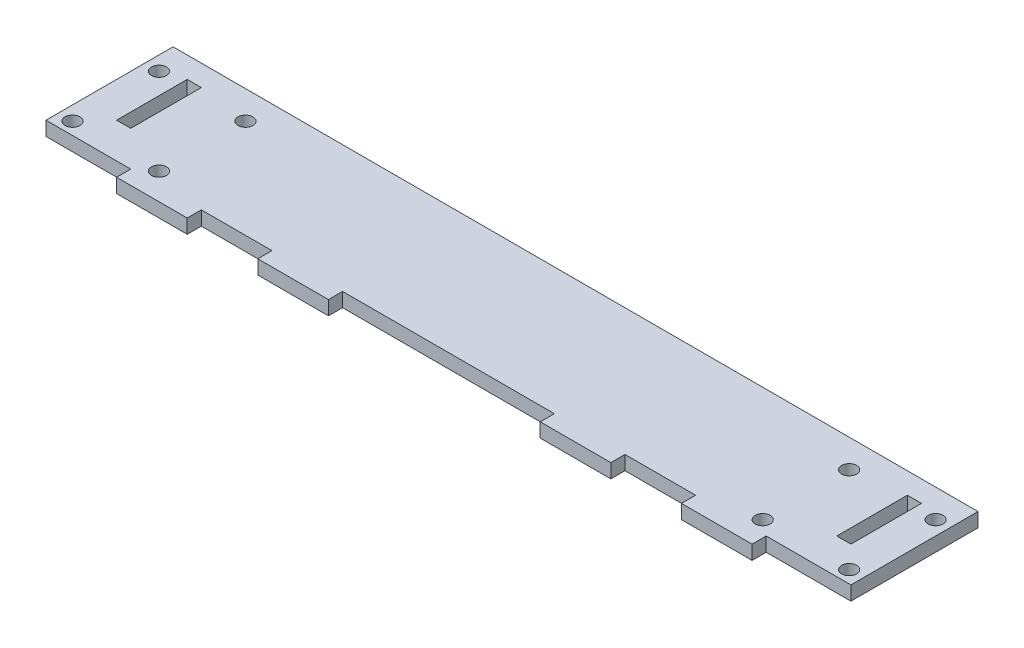
ISO-10303-21;
HEADER;
FILE_DESCRIPTION(('STEP AP214'),'2;1');
FILE_NAME('part.step','',(''),(''),'','','');
FILE_SCHEMA(('AUTOMOTIVE_DESIGN { 1 0 10303 214 1 1 1 1 }'));
ENDSEC;
DATA;
#1=APPLICATION_CONTEXT('core data for automotive mechanical design processes');
#2=APPLICATION_PROTOCOL_DEFINITION('international standard','automotive_design',2000,#1);
#3=PRODUCT_CONTEXT('',#1,'mechanical');
#4=PRODUCT('Part','Part','',(#3));
#5=PRODUCT_RELATED_PRODUCT_CATEGORY('part','',(#4));
#6=PRODUCT_DEFINITION_FORMATION('','',#4);
#7=PRODUCT_DEFINITION_CONTEXT('part definition',#1,'design');
#8=PRODUCT_DEFINITION('design','',#6,#7);
#9=PRODUCT_DEFINITION_SHAPE('','',#8);
#10=(LENGTH_UNIT() NAMED_UNIT(*) SI_UNIT(.MILLI.,.METRE.));
#11=(NAMED_UNIT(*) PLANE_ANGLE_UNIT() SI_UNIT($,.RADIAN.));
#12=(NAMED_UNIT(*) SI_UNIT($,.STERADIAN.) SOLID_ANGLE_UNIT());
#13=UNCERTAINTY_MEASURE_WITH_UNIT(LENGTH_MEASURE(1.E-05),#10,'distance_accuracy_value','');
#14=(GEOMETRIC_REPRESENTATION_CONTEXT(3) GLOBAL_UNCERTAINTY_ASSIGNED_CONTEXT((#13)) GLOBAL_UNIT_ASSIGNED_CONTEXT((#10,
#11,#12)) REPRESENTATION_CONTEXT('',''));
#15=CARTESIAN_POINT('',(0.,0.,0.));
#16=DIRECTION('',(0.,0.,1.));
#17=DIRECTION('',(1.,0.,0.));
#18=AXIS2_PLACEMENT_3D('',#15,#16,#17);
#19=CARTESIAN_POINT('',(0.,0.,0.));
#20=DIRECTION('',(0.,1.,0.));
#21=DIRECTION('',(0.,0.,1.));
#22=AXIS2_PLACEMENT_3D('',#19,#20,#21);
#23=PLANE('',#22);
#24=DIRECTION('',(0.,0.,1.));
#25=VECTOR('',#24,1.);
#26=CARTESIAN_POINT('',(24.,0.,0.));
#27=LINE('',#26,#25);
#28=CARTESIAN_POINT('',(24.,0.,0.));
#29=VERTEX_POINT('',#28);
#30=CARTESIAN_POINT('',(24.,0.,4.));
#31=VERTEX_POINT('',#30);
#32=EDGE_CURVE('E326',#29,#31,#27,.T.);
#33=ORIENTED_EDGE('',*,*,#32,.F.);
#34=DIRECTION('',(1.,0.,0.));
#35=VECTOR('',#34,1.);
#36=CARTESIAN_POINT('',(0.,0.,0.));
#37=LINE('',#36,#35);
#38=CARTESIAN_POINT('',(0.,0.,0.));
#39=VERTEX_POINT('',#38);
#40=EDGE_CURVE('E316',#39,#29,#37,.T.);
#41=ORIENTED_EDGE('',*,*,#40,.F.);
#42=DIRECTION('',(0.,0.,-1.));
#43=VECTOR('',#42,1.);
#44=CARTESIAN_POINT('',(0.,0.,0.));
#45=LINE('',#44,#43);
#46=CARTESIAN_POINT('',(0.,0.,-36.));
#47=VERTEX_POINT('',#46);
#48=EDGE_CURVE('E360',#39,#47,#45,.T.);
#49=ORIENTED_EDGE('',*,*,#48,.T.);
#50=DIRECTION('',(1.,0.,0.));
#51=VECTOR('',#50,1.);
#52=CARTESIAN_POINT('',(0.,0.,-36.));
#53=LINE('',#52,#51);
#54=CARTESIAN_POINT('',(228.,0.,-36.));
#55=VERTEX_POINT('',#54);
#56=EDGE_CURVE('E348',#47,#55,#53,.T.);
#57=ORIENTED_EDGE('',*,*,#56,.T.);
#58=DIRECTION('',(0.,0.,-1.));
#59=VECTOR('',#58,1.);
#60=CARTESIAN_POINT('',(228.,0.,0.));
#61=LINE('',#60,#59);
#62=CARTESIAN_POINT('',(228.,0.,0.));
#63=VERTEX_POINT('',#62);
#64=EDGE_CURVE('E341',#63,#55,#61,.T.);
#65=ORIENTED_EDGE('',*,*,#64,.F.);
#66=CARTESIAN_POINT('',(204.,0.,0.));
#67=VERTEX_POINT('',#66);
#68=EDGE_CURVE('E322',#67,#63,#37,.T.);
#69=ORIENTED_EDGE('',*,*,#68,.F.);
#70=DIRECTION('',(0.,0.,1.));
#71=VECTOR('',#70,1.);
#72=CARTESIAN_POINT('',(204.,0.,0.));
#73=LINE('',#72,#71);
#74=CARTESIAN_POINT('',(204.,0.,4.00000000000001));
#75=VERTEX_POINT('',#74);
#76=EDGE_CURVE('E342',#67,#75,#73,.T.);
#77=ORIENTED_EDGE('',*,*,#76,.T.);
#78=DIRECTION('',(1.,0.,0.));
#79=VECTOR('',#78,1.);
#80=CARTESIAN_POINT('',(0.,0.,3.99999999999992));
#81=LINE('',#80,#79);
#82=CARTESIAN_POINT('',(184.,0.,4.));
#83=VERTEX_POINT('',#82);
#84=EDGE_CURVE('E336',#83,#75,#81,.T.);
#85=ORIENTED_EDGE('',*,*,#84,.F.);
#86=DIRECTION('',(0.,0.,1.));
#87=VECTOR('',#86,1.);
#88=CARTESIAN_POINT('',(184.,0.,0.));
#89=LINE('',#88,#87);
#90=CARTESIAN_POINT('',(184.,0.,0.));
#91=VERTEX_POINT('',#90);
#92=EDGE_CURVE('E329',#91,#83,#89,.T.);
#93=ORIENTED_EDGE('',*,*,#92,.F.);
#94=CARTESIAN_POINT('',(164.,0.,0.));
#95=VERTEX_POINT('',#94);
#96=EDGE_CURVE('E317',#95,#91,#37,.T.);
#97=ORIENTED_EDGE('',*,*,#96,.F.);
#98=DIRECTION('',(0.,0.,1.));
#99=VECTOR('',#98,1.);
#100=CARTESIAN_POINT('',(164.,0.,0.));
#101=LINE('',#100,#99);
#102=CARTESIAN_POINT('',(164.,0.,4.00000000000001));
#103=VERTEX_POINT('',#102);
#104=EDGE_CURVE('E330',#95,#103,#101,.T.);
#105=ORIENTED_EDGE('',*,*,#104,.T.);
#106=DIRECTION('',(1.,0.,0.));
#107=VECTOR('',#106,1.);
#108=CARTESIAN_POINT('',(0.,0.,3.99999999999994));
#109=LINE('',#108,#107);
#110=CARTESIAN_POINT('',(144.,0.,4.));
#111=VERTEX_POINT('',#110);
#112=EDGE_CURVE('E319',#111,#103,#109,.T.);
#113=ORIENTED_EDGE('',*,*,#112,.F.);
#114=DIRECTION('',(0.,0.,1.));
#115=VECTOR('',#114,1.);
#116=CARTESIAN_POINT('',(144.,0.,0.));
#117=LINE('',#116,#115);
#118=CARTESIAN_POINT('',(144.,0.,0.));
#119=VERTEX_POINT('',#118);
#120=EDGE_CURVE('E314',#119,#111,#117,.T.);
#121=ORIENTED_EDGE('',*,*,#120,.F.);
#122=CARTESIAN_POINT('',(84.,0.,0.));
#123=VERTEX_POINT('',#122);
#124=EDGE_CURVE('E211',#123,#119,#37,.T.);
#125=ORIENTED_EDGE('',*,*,#124,.F.);
#126=DIRECTION('',(0.,0.,1.));
#127=VECTOR('',#126,1.);
#128=CARTESIAN_POINT('',(84.,0.,0.));
#129=LINE('',#128,#127);
#130=CARTESIAN_POINT('',(84.,0.,4.00000000000001));
#131=VERTEX_POINT('',#130);
#132=EDGE_CURVE('E198',#123,#131,#129,.T.);
#133=ORIENTED_EDGE('',*,*,#132,.T.);
#134=DIRECTION('',(1.,0.,0.));
#135=VECTOR('',#134,1.);
#136=CARTESIAN_POINT('',(64.,0.,4.));
#137=LINE('',#136,#135);
#138=CARTESIAN_POINT('',(64.,0.,4.));
#139=VERTEX_POINT('',#138);
#140=EDGE_CURVE('E192',#139,#131,#137,.T.);
#141=ORIENTED_EDGE('',*,*,#140,.F.);
#142=DIRECTION('',(0.,0.,1.));
#143=VECTOR('',#142,1.);
#144=CARTESIAN_POINT('',(64.,0.,0.));
#145=LINE('',#144,#143);
#146=CARTESIAN_POINT('',(64.,0.,0.));
#147=VERTEX_POINT('',#146);
#148=EDGE_CURVE('E205',#147,#139,#145,.T.);
#149=ORIENTED_EDGE('',*,*,#148,.F.);
#150=CARTESIAN_POINT('',(44.,0.,0.));
#151=VERTEX_POINT('',#150);
#152=EDGE_CURVE('E306',#151,#147,#37,.T.);
#153=ORIENTED_EDGE('',*,*,#152,.F.);
#154=DIRECTION('',(0.,0.,1.));
#155=VECTOR('',#154,1.);
#156=CARTESIAN_POINT('',(44.,0.,0.));
#157=LINE('',#156,#155);
#158=CARTESIAN_POINT('',(44.,0.,4.00000000000001));
#159=VERTEX_POINT('',#158);
#160=EDGE_CURVE('E321',#151,#159,#157,.T.);
#161=ORIENTED_EDGE('',*,*,#160,.T.);
#162=DIRECTION('',(1.,0.,0.));
#163=VECTOR('',#162,1.);
#164=CARTESIAN_POINT('',(0.,0.,3.99999999999999));
#165=LINE('',#164,#163);
#166=EDGE_CURVE('E736',#31,#159,#165,.T.);
#167=ORIENTED_EDGE('',*,*,#166,.F.);
#168=EDGE_LOOP('',(#33,#41,#49,#57,#65,#69,#77,#85,#93,#97,#105,#113,#121,#125,#133,#141,#149,
#153,#161,#167));
#169=FACE_BOUND('',#168,.T.);
#170=CARTESIAN_POINT('',(199.5,0.,-3.50000000000002));
#171=DIRECTION('',(0.,1.,0.));
#172=DIRECTION('',(0.,0.,1.));
#173=AXIS2_PLACEMENT_3D('',#170,#171,#172);
#174=CIRCLE('',#173,2.125);
#175=CARTESIAN_POINT('',(199.5,0.,-1.37500000000002));
#176=VERTEX_POINT('',#175);
#177=EDGE_CURVE('E376',#176,#176,#174,.F.);
#178=ORIENTED_EDGE('',*,*,#177,.F.);
#179=EDGE_LOOP('',(#178));
#180=FACE_BOUND('',#179,.T.);
#181=CARTESIAN_POINT('',(224.,0.,-3.50000000000003));
#182=DIRECTION('',(0.,1.,0.));
#183=DIRECTION('',(0.,0.,1.));
#184=AXIS2_PLACEMENT_3D('',#181,#182,#183);
#185=CIRCLE('',#184,2.125);
#186=CARTESIAN_POINT('',(224.,0.,-1.37500000000003));
#187=VERTEX_POINT('',#186);
#188=EDGE_CURVE('E373',#187,#187,#185,.F.);
#189=ORIENTED_EDGE('',*,*,#188,.F.);
#190=EDGE_LOOP('',(#189));
#191=FACE_BOUND('',#190,.T.);
#192=DIRECTION('',(1.,0.,0.));
#193=VECTOR('',#192,1.);
#194=CARTESIAN_POINT('',(0.,0.,-30.));
#195=LINE('',#194,#193);
#196=CARTESIAN_POINT('',(10.,0.,-30.));
#197=VERTEX_POINT('',#196);
#198=CARTESIAN_POINT('',(14.,0.,-30.));
#199=VERTEX_POINT('',#198);
#200=EDGE_CURVE('E363',#197,#199,#195,.T.);
#201=ORIENTED_EDGE('',*,*,#200,.F.);
#202=DIRECTION('',(0.,0.,1.));
#203=VECTOR('',#202,1.);
#204=CARTESIAN_POINT('',(10.,0.,0.));
#205=LINE('',#204,#203);
#206=CARTESIAN_POINT('',(10.,0.,-10.));
#207=VERTEX_POINT('',#206);
#208=EDGE_CURVE('E370',#197,#207,#205,.T.);
#209=ORIENTED_EDGE('',*,*,#208,.T.);
#210=DIRECTION('',(1.,0.,0.));
#211=VECTOR('',#210,1.);
#212=CARTESIAN_POINT('',(0.,0.,-10.));
#213=LINE('',#212,#211);
#214=CARTESIAN_POINT('',(14.,0.,-10.));
#215=VERTEX_POINT('',#214);
#216=EDGE_CURVE('E367',#207,#215,#213,.T.);
#217=ORIENTED_EDGE('',*,*,#216,.T.);
#218=DIRECTION('',(0.,0.,1.));
#219=VECTOR('',#218,1.);
#220=CARTESIAN_POINT('',(14.,0.,0.));
#221=LINE('',#220,#219);
#222=EDGE_CURVE('E365',#199,#215,#221,.T.);
#223=ORIENTED_EDGE('',*,*,#222,.F.);
#224=EDGE_LOOP('',(#201,#209,#217,#223));
#225=FACE_BOUND('',#224,.T.);
#226=DIRECTION('',(-1.,0.,0.));
#227=VECTOR('',#226,1.);
#228=CARTESIAN_POINT('',(0.,0.,-30.));
#229=LINE('',#228,#227);
#230=CARTESIAN_POINT('',(218.,0.,-30.));
#231=VERTEX_POINT('',#230);
#232=CARTESIAN_POINT('',(214.,0.,-30.));
#233=VERTEX_POINT('',#232);
#234=EDGE_CURVE('E523',#231,#233,#229,.T.);
#235=ORIENTED_EDGE('',*,*,#234,.T.);
#236=DIRECTION('',(0.,0.,1.));
#237=VECTOR('',#236,1.);
#238=CARTESIAN_POINT('',(214.,0.,0.));
#239=LINE('',#238,#237);
#240=CARTESIAN_POINT('',(214.,0.,-10.));
#241=VERTEX_POINT('',#240);
#242=EDGE_CURVE('E327',#233,#241,#239,.T.);
#243=ORIENTED_EDGE('',*,*,#242,.T.);
#244=DIRECTION('',(-1.,0.,0.));
#245=VECTOR('',#244,1.);
#246=CARTESIAN_POINT('',(0.,0.,-10.));
#247=LINE('',#246,#245);
#248=CARTESIAN_POINT('',(218.,0.,-10.));
#249=VERTEX_POINT('',#248);
#250=EDGE_CURVE('E617',#249,#241,#247,.T.);
#251=ORIENTED_EDGE('',*,*,#250,.F.);
#252=DIRECTION('',(0.,0.,1.));
#253=VECTOR('',#252,1.);
#254=CARTESIAN_POINT('',(218.,0.,0.));
#255=LINE('',#254,#253);
#256=EDGE_CURVE('E615',#231,#249,#255,.T.);
#257=ORIENTED_EDGE('',*,*,#256,.F.);
#258=EDGE_LOOP('',(#235,#243,#251,#257));
#259=FACE_BOUND('',#258,.T.);
#260=CARTESIAN_POINT('',(4.,0.,-3.5));
#261=DIRECTION('',(0.,1.,0.));
#262=DIRECTION('',(0.,0.,1.));
#263=AXIS2_PLACEMENT_3D('',#260,#261,#262);
#264=CIRCLE('',#263,2.125);
#265=CARTESIAN_POINT('',(4.,0.,-1.375));
#266=VERTEX_POINT('',#265);
#267=EDGE_CURVE('E611',#266,#266,#264,.T.);
#268=ORIENTED_EDGE('',*,*,#267,.T.);
#269=EDGE_LOOP('',(#268));
#270=FACE_BOUND('',#269,.T.);
#271=CARTESIAN_POINT('',(4.,0.,-28.));
#272=DIRECTION('',(0.,1.,0.));
#273=DIRECTION('',(0.,0.,1.));
#274=AXIS2_PLACEMENT_3D('',#271,#272,#273);
#275=CIRCLE('',#274,2.125);
#276=CARTESIAN_POINT('',(4.,0.,-25.875));
#277=VERTEX_POINT('',#276);
#278=EDGE_CURVE('E608',#277,#277,#275,.T.);
#279=ORIENTED_EDGE('',*,*,#278,.T.);
#280=EDGE_LOOP('',(#279));
#281=FACE_BOUND('',#280,.T.);
#282=CARTESIAN_POINT('',(224.,0.,-28.));
#283=DIRECTION('',(0.,1.,0.));
#284=DIRECTION('',(0.,0.,1.));
#285=AXIS2_PLACEMENT_3D('',#282,#283,#284);
#286=CIRCLE('',#285,2.125);
#287=CARTESIAN_POINT('',(224.,0.,-25.875));
#288=VERTEX_POINT('',#287);
#289=EDGE_CURVE('E605',#288,#288,#286,.F.);
#290=ORIENTED_EDGE('',*,*,#289,.F.);
#291=EDGE_LOOP('',(#290));
#292=FACE_BOUND('',#291,.T.);
#293=CARTESIAN_POINT('',(28.5,0.,-3.49999999999999));
#294=DIRECTION('',(0.,1.,0.));
#295=DIRECTION('',(0.,0.,1.));
#296=AXIS2_PLACEMENT_3D('',#293,#294,#295);
#297=CIRCLE('',#296,2.125);
#298=CARTESIAN_POINT('',(28.5,0.,-1.37499999999999));
#299=VERTEX_POINT('',#298);
#300=EDGE_CURVE('E602',#299,#299,#297,.T.);
#301=ORIENTED_EDGE('',*,*,#300,.T.);
#302=EDGE_LOOP('',(#301));
#303=FACE_BOUND('',#302,.T.);
#304=CARTESIAN_POINT('',(28.5,0.,-28.));
#305=DIRECTION('',(0.,1.,0.));
#306=DIRECTION('',(0.,0.,1.));
#307=AXIS2_PLACEMENT_3D('',#304,#305,#306);
#308=CIRCLE('',#307,2.125);
#309=CARTESIAN_POINT('',(28.5,0.,-25.875));
#310=VERTEX_POINT('',#309);
#311=EDGE_CURVE('E599',#310,#310,#308,.T.);
#312=ORIENTED_EDGE('',*,*,#311,.T.);
#313=EDGE_LOOP('',(#312));
#314=FACE_BOUND('',#313,.T.);
#315=CARTESIAN_POINT('',(199.5,0.,-28.));
#316=DIRECTION('',(0.,1.,0.));
#317=DIRECTION('',(0.,0.,1.));
#318=AXIS2_PLACEMENT_3D('',#315,#316,#317);
#319=CIRCLE('',#318,2.125);
#320=CARTESIAN_POINT('',(199.5,0.,-25.875));
#321=VERTEX_POINT('',#320);
#322=EDGE_CURVE('E596',#321,#321,#319,.F.);
#323=ORIENTED_EDGE('',*,*,#322,.F.);
#324=EDGE_LOOP('',(#323));
#325=FACE_BOUND('',#324,.T.);
#326=ADVANCED_FACE('F155',(#169,#180,#191,#225,#259,#270,#281,#292,#303,#314,#325),#23,.F.);
#327=CARTESIAN_POINT('',(0.,4.,3.99999999999999));
#328=DIRECTION('',(0.,0.,-1.));
#329=DIRECTION('',(-1.,0.,0.));
#330=AXIS2_PLACEMENT_3D('',#327,#328,#329);
#331=PLANE('',#330);
#332=ORIENTED_EDGE('',*,*,#166,.T.);
#333=DIRECTION('',(0.,-1.,0.));
#334=VECTOR('',#333,1.);
#335=CARTESIAN_POINT('',(44.,4.,4.00000000000001));
#336=LINE('',#335,#334);
#337=CARTESIAN_POINT('',(44.,4.,4.00000000000001));
#338=VERTEX_POINT('',#337);
#339=EDGE_CURVE('E276',#338,#159,#336,.T.);
#340=ORIENTED_EDGE('',*,*,#339,.F.);
#341=DIRECTION('',(1.,0.,0.));
#342=VECTOR('',#341,1.);
#343=CARTESIAN_POINT('',(0.,4.,3.99999999999999));
#344=LINE('',#343,#342);
#345=CARTESIAN_POINT('',(24.,4.,4.));
#346=VERTEX_POINT('',#345);
#347=EDGE_CURVE('E554',#346,#338,#344,.T.);
#348=ORIENTED_EDGE('',*,*,#347,.F.);
#349=DIRECTION('',(0.,-1.,0.));
#350=VECTOR('',#349,1.);
#351=CARTESIAN_POINT('',(24.,4.,4.));
#352=LINE('',#351,#350);
#353=EDGE_CURVE('E279',#346,#31,#352,.T.);
#354=ORIENTED_EDGE('',*,*,#353,.T.);
#355=EDGE_LOOP('',(#332,#340,#348,#354));
#356=FACE_BOUND('',#355,.T.);
#357=ADVANCED_FACE('F636',(#356),#331,.F.);
#358=CARTESIAN_POINT('',(44.,4.,0.));
#359=DIRECTION('',(1.,0.,0.));
#360=DIRECTION('',(0.,0.,-1.));
#361=AXIS2_PLACEMENT_3D('',#358,#359,#360);
#362=PLANE('',#361);
#363=ORIENTED_EDGE('',*,*,#160,.F.);
#364=DIRECTION('',(0.,-1.,0.));
#365=VECTOR('',#364,1.);
#366=CARTESIAN_POINT('',(44.,4.,0.));
#367=LINE('',#366,#365);
#368=CARTESIAN_POINT('',(44.,4.,0.));
#369=VERTEX_POINT('',#368);
#370=EDGE_CURVE('E273',#369,#151,#367,.T.);
#371=ORIENTED_EDGE('',*,*,#370,.F.);
#372=DIRECTION('',(0.,0.,1.));
#373=VECTOR('',#372,1.);
#374=CARTESIAN_POINT('',(44.,4.,0.));
#375=LINE('',#374,#373);
#376=EDGE_CURVE('E556',#369,#338,#375,.T.);
#377=ORIENTED_EDGE('',*,*,#376,.T.);
#378=ORIENTED_EDGE('',*,*,#339,.T.);
#379=EDGE_LOOP('',(#363,#371,#377,#378));
#380=FACE_BOUND('',#379,.T.);
#381=ADVANCED_FACE('F638',(#380),#362,.T.);
#382=CARTESIAN_POINT('',(24.,4.,0.));
#383=DIRECTION('',(1.,0.,0.));
#384=DIRECTION('',(0.,0.,-1.));
#385=AXIS2_PLACEMENT_3D('',#382,#383,#384);
#386=PLANE('',#385);
#387=ORIENTED_EDGE('',*,*,#32,.T.);
#388=ORIENTED_EDGE('',*,*,#353,.F.);
#389=DIRECTION('',(0.,0.,1.));
#390=VECTOR('',#389,1.);
#391=CARTESIAN_POINT('',(24.,4.,0.));
#392=LINE('',#391,#390);
#393=CARTESIAN_POINT('',(24.,4.,0.));
#394=VERTEX_POINT('',#393);
#395=EDGE_CURVE('E550',#394,#346,#392,.T.);
#396=ORIENTED_EDGE('',*,*,#395,.F.);
#397=DIRECTION('',(0.,-1.,0.));
#398=VECTOR('',#397,1.);
#399=CARTESIAN_POINT('',(24.,4.,0.));
#400=LINE('',#399,#398);
#401=EDGE_CURVE('E282',#394,#29,#400,.T.);
#402=ORIENTED_EDGE('',*,*,#401,.T.);
#403=EDGE_LOOP('',(#387,#388,#396,#402));
#404=FACE_BOUND('',#403,.T.);
#405=ADVANCED_FACE('F645',(#404),#386,.F.);
#406=CARTESIAN_POINT('',(0.,4.,0.));
#407=DIRECTION('',(0.,1.,0.));
#408=DIRECTION('',(0.,0.,1.));
#409=AXIS2_PLACEMENT_3D('',#406,#407,#408);
#410=PLANE('',#409);
#411=ORIENTED_EDGE('',*,*,#376,.F.);
#412=DIRECTION('',(1.,0.,0.));
#413=VECTOR('',#412,1.);
#414=CARTESIAN_POINT('',(0.,4.,0.));
#415=LINE('',#414,#413);
#416=CARTESIAN_POINT('',(64.,4.,0.));
#417=VERTEX_POINT('',#416);
#418=EDGE_CURVE('E552',#369,#417,#415,.T.);
#419=ORIENTED_EDGE('',*,*,#418,.T.);
#420=DIRECTION('',(0.,0.,1.));
#421=VECTOR('',#420,1.);
#422=CARTESIAN_POINT('',(64.,4.,0.));
#423=LINE('',#422,#421);
#424=CARTESIAN_POINT('',(64.,4.,4.));
#425=VERTEX_POINT('',#424);
#426=EDGE_CURVE('E212',#417,#425,#423,.T.);
#427=ORIENTED_EDGE('',*,*,#426,.T.);
#428=DIRECTION('',(1.,0.,0.));
#429=VECTOR('',#428,1.);
#430=CARTESIAN_POINT('',(64.,4.,4.));
#431=LINE('',#430,#429);
#432=CARTESIAN_POINT('',(84.,4.,4.00000000000001));
#433=VERTEX_POINT('',#432);
#434=EDGE_CURVE('E215',#425,#433,#431,.T.);
#435=ORIENTED_EDGE('',*,*,#434,.T.);
#436=DIRECTION('',(0.,0.,1.));
#437=VECTOR('',#436,1.);
#438=CARTESIAN_POINT('',(84.,4.,0.));
#439=LINE('',#438,#437);
#440=CARTESIAN_POINT('',(84.,4.,0.));
#441=VERTEX_POINT('',#440);
#442=EDGE_CURVE('E200',#441,#433,#439,.T.);
#443=ORIENTED_EDGE('',*,*,#442,.F.);
#444=CARTESIAN_POINT('',(144.,4.,0.));
#445=VERTEX_POINT('',#444);
#446=EDGE_CURVE('E551',#441,#445,#415,.T.);
#447=ORIENTED_EDGE('',*,*,#446,.T.);
#448=DIRECTION('',(0.,0.,1.));
#449=VECTOR('',#448,1.);
#450=CARTESIAN_POINT('',(144.,4.,0.));
#451=LINE('',#450,#449);
#452=CARTESIAN_POINT('',(144.,4.,4.));
#453=VERTEX_POINT('',#452);
#454=EDGE_CURVE('E559',#445,#453,#451,.T.);
#455=ORIENTED_EDGE('',*,*,#454,.T.);
#456=DIRECTION('',(1.,0.,0.));
#457=VECTOR('',#456,1.);
#458=CARTESIAN_POINT('',(0.,4.,3.99999999999994));
#459=LINE('',#458,#457);
#460=CARTESIAN_POINT('',(164.,4.,4.00000000000001));
#461=VERTEX_POINT('',#460);
#462=EDGE_CURVE('E561',#453,#461,#459,.T.);
#463=ORIENTED_EDGE('',*,*,#462,.T.);
#464=DIRECTION('',(0.,0.,1.));
#465=VECTOR('',#464,1.);
#466=CARTESIAN_POINT('',(164.,4.,0.));
#467=LINE('',#466,#465);
#468=CARTESIAN_POINT('',(164.,4.,0.));
#469=VERTEX_POINT('',#468);
#470=EDGE_CURVE('E563',#469,#461,#467,.T.);
#471=ORIENTED_EDGE('',*,*,#470,.F.);
#472=CARTESIAN_POINT('',(184.,4.,0.));
#473=VERTEX_POINT('',#472);
#474=EDGE_CURVE('E566',#469,#473,#415,.T.);
#475=ORIENTED_EDGE('',*,*,#474,.T.);
#476=DIRECTION('',(0.,0.,1.));
#477=VECTOR('',#476,1.);
#478=CARTESIAN_POINT('',(184.,4.,0.));
#479=LINE('',#478,#477);
#480=CARTESIAN_POINT('',(184.,4.,4.));
#481=VERTEX_POINT('',#480);
#482=EDGE_CURVE('E567',#473,#481,#479,.T.);
#483=ORIENTED_EDGE('',*,*,#482,.T.);
#484=DIRECTION('',(1.,0.,0.));
#485=VECTOR('',#484,1.);
#486=CARTESIAN_POINT('',(0.,4.,3.99999999999992));
#487=LINE('',#486,#485);
#488=CARTESIAN_POINT('',(204.,4.,4.00000000000001));
#489=VERTEX_POINT('',#488);
#490=EDGE_CURVE('E569',#481,#489,#487,.T.);
#491=ORIENTED_EDGE('',*,*,#490,.T.);
#492=DIRECTION('',(0.,0.,1.));
#493=VECTOR('',#492,1.);
#494=CARTESIAN_POINT('',(204.,4.,0.));
#495=LINE('',#494,#493);
#496=CARTESIAN_POINT('',(204.,4.,0.));
#497=VERTEX_POINT('',#496);
#498=EDGE_CURVE('E571',#497,#489,#495,.T.);
#499=ORIENTED_EDGE('',*,*,#498,.F.);
#500=CARTESIAN_POINT('',(228.,4.,0.));
#501=VERTEX_POINT('',#500);
#502=EDGE_CURVE('E574',#497,#501,#415,.T.);
#503=ORIENTED_EDGE('',*,*,#502,.T.);
#504=DIRECTION('',(0.,0.,-1.));
#505=VECTOR('',#504,1.);
#506=CARTESIAN_POINT('',(228.,4.,0.));
#507=LINE('',#506,#505);
#508=CARTESIAN_POINT('',(228.,4.,-36.));
#509=VERTEX_POINT('',#508);
#510=EDGE_CURVE('E575',#501,#509,#507,.T.);
#511=ORIENTED_EDGE('',*,*,#510,.T.);
#512=DIRECTION('',(1.,0.,0.));
#513=VECTOR('',#512,1.);
#514=CARTESIAN_POINT('',(0.,4.,-36.));
#515=LINE('',#514,#513);
#516=CARTESIAN_POINT('',(0.,4.,-36.));
#517=VERTEX_POINT('',#516);
#518=EDGE_CURVE('E577',#517,#509,#515,.T.);
#519=ORIENTED_EDGE('',*,*,#518,.F.);
#520=DIRECTION('',(0.,0.,-1.));
#521=VECTOR('',#520,1.);
#522=CARTESIAN_POINT('',(0.,4.,0.));
#523=LINE('',#522,#521);
#524=CARTESIAN_POINT('',(0.,4.,0.));
#525=VERTEX_POINT('',#524);
#526=EDGE_CURVE('E580',#525,#517,#523,.T.);
#527=ORIENTED_EDGE('',*,*,#526,.F.);
#528=EDGE_CURVE('E547',#525,#394,#415,.T.);
#529=ORIENTED_EDGE('',*,*,#528,.T.);
#530=ORIENTED_EDGE('',*,*,#395,.T.);
#531=ORIENTED_EDGE('',*,*,#347,.T.);
#532=EDGE_LOOP('',(#411,#419,#427,#435,#443,#447,#455,#463,#471,#475,#483,#491,#499,#503,#511,
#519,#527,#529,#530,#531));
#533=FACE_BOUND('',#532,.T.);
#534=CARTESIAN_POINT('',(199.5,4.,-28.));
#535=DIRECTION('',(0.,1.,0.));
#536=DIRECTION('',(0.,0.,1.));
#537=AXIS2_PLACEMENT_3D('',#534,#535,#536);
#538=CIRCLE('',#537,2.125);
#539=CARTESIAN_POINT('',(199.5,4.,-25.875));
#540=VERTEX_POINT('',#539);
#541=EDGE_CURVE('E379',#540,#540,#538,.F.);
#542=ORIENTED_EDGE('',*,*,#541,.T.);
#543=EDGE_LOOP('',(#542));
#544=FACE_BOUND('',#543,.T.);
#545=CARTESIAN_POINT('',(28.5,4.,-28.));
#546=DIRECTION('',(0.,1.,0.));
#547=DIRECTION('',(0.,0.,1.));
#548=AXIS2_PLACEMENT_3D('',#545,#546,#547);
#549=CIRCLE('',#548,2.125);
#550=CARTESIAN_POINT('',(28.5,4.,-25.875));
#551=VERTEX_POINT('',#550);
#552=EDGE_CURVE('E1150',#551,#551,#549,.T.);
#553=ORIENTED_EDGE('',*,*,#552,.F.);
#554=EDGE_LOOP('',(#553));
#555=FACE_BOUND('',#554,.T.);
#556=CARTESIAN_POINT('',(28.5,4.,-3.49999999999999));
#557=DIRECTION('',(0.,1.,0.));
#558=DIRECTION('',(0.,0.,1.));
#559=AXIS2_PLACEMENT_3D('',#556,#557,#558);
#560=CIRCLE('',#559,2.125);
#561=CARTESIAN_POINT('',(28.5,4.,-1.37499999999999));
#562=VERTEX_POINT('',#561);
#563=EDGE_CURVE('E1145',#562,#562,#560,.T.);
#564=ORIENTED_EDGE('',*,*,#563,.F.);
#565=EDGE_LOOP('',(#564));
#566=FACE_BOUND('',#565,.T.);
#567=CARTESIAN_POINT('',(224.,4.,-28.));
#568=DIRECTION('',(0.,1.,0.));
#569=DIRECTION('',(0.,0.,1.));
#570=AXIS2_PLACEMENT_3D('',#567,#568,#569);
#571=CIRCLE('',#570,2.125);
#572=CARTESIAN_POINT('',(224.,4.,-25.875));
#573=VERTEX_POINT('',#572);
#574=EDGE_CURVE('E1143',#573,#573,#571,.F.);
#575=ORIENTED_EDGE('',*,*,#574,.T.);
#576=EDGE_LOOP('',(#575));
#577=FACE_BOUND('',#576,.T.);
#578=CARTESIAN_POINT('',(4.,4.,-28.));
#579=DIRECTION('',(0.,1.,0.));
#580=DIRECTION('',(0.,0.,1.));
#581=AXIS2_PLACEMENT_3D('',#578,#579,#580);
#582=CIRCLE('',#581,2.125);
#583=CARTESIAN_POINT('',(4.,4.,-25.875));
#584=VERTEX_POINT('',#583);
#585=EDGE_CURVE('E541',#584,#584,#582,.T.);
#586=ORIENTED_EDGE('',*,*,#585,.F.);
#587=EDGE_LOOP('',(#586));
#588=FACE_BOUND('',#587,.T.);
#589=CARTESIAN_POINT('',(4.,4.,-3.5));
#590=DIRECTION('',(0.,1.,0.));
#591=DIRECTION('',(0.,0.,1.));
#592=AXIS2_PLACEMENT_3D('',#589,#590,#591);
#593=CIRCLE('',#592,2.125);
#594=CARTESIAN_POINT('',(4.,4.,-1.375));
#595=VERTEX_POINT('',#594);
#596=EDGE_CURVE('E538',#595,#595,#593,.T.);
#597=ORIENTED_EDGE('',*,*,#596,.F.);
#598=EDGE_LOOP('',(#597));
#599=FACE_BOUND('',#598,.T.);
#600=DIRECTION('',(-1.,0.,0.));
#601=VECTOR('',#600,1.);
#602=CARTESIAN_POINT('',(0.,4.,-30.));
#603=LINE('',#602,#601);
#604=CARTESIAN_POINT('',(218.,4.,-30.));
#605=VERTEX_POINT('',#604);
#606=CARTESIAN_POINT('',(214.,4.,-30.));
#607=VERTEX_POINT('',#606);
#608=EDGE_CURVE('E520',#605,#607,#603,.T.);
#609=ORIENTED_EDGE('',*,*,#608,.F.);
#610=DIRECTION('',(0.,0.,1.));
#611=VECTOR('',#610,1.);
#612=CARTESIAN_POINT('',(218.,4.,0.));
#613=LINE('',#612,#611);
#614=CARTESIAN_POINT('',(218.,4.,-10.));
#615=VERTEX_POINT('',#614);
#616=EDGE_CURVE('E529',#605,#615,#613,.T.);
#617=ORIENTED_EDGE('',*,*,#616,.T.);
#618=DIRECTION('',(-1.,0.,0.));
#619=VECTOR('',#618,1.);
#620=CARTESIAN_POINT('',(0.,4.,-10.));
#621=LINE('',#620,#619);
#622=CARTESIAN_POINT('',(214.,4.,-10.));
#623=VERTEX_POINT('',#622);
#624=EDGE_CURVE('E532',#615,#623,#621,.T.);
#625=ORIENTED_EDGE('',*,*,#624,.T.);
#626=DIRECTION('',(0.,0.,1.));
#627=VECTOR('',#626,1.);
#628=CARTESIAN_POINT('',(214.,4.,0.));
#629=LINE('',#628,#627);
#630=EDGE_CURVE('E537',#607,#623,#629,.T.);
#631=ORIENTED_EDGE('',*,*,#630,.F.);
#632=EDGE_LOOP('',(#609,#617,#625,#631));
#633=FACE_BOUND('',#632,.T.);
#634=DIRECTION('',(1.,0.,0.));
#635=VECTOR('',#634,1.);
#636=CARTESIAN_POINT('',(0.,4.,-30.));
#637=LINE('',#636,#635);
#638=CARTESIAN_POINT('',(10.,4.,-30.));
#639=VERTEX_POINT('',#638);
#640=CARTESIAN_POINT('',(14.,4.,-30.));
#641=VERTEX_POINT('',#640);
#642=EDGE_CURVE('E583',#639,#641,#637,.T.);
#643=ORIENTED_EDGE('',*,*,#642,.T.);
#644=DIRECTION('',(0.,0.,1.));
#645=VECTOR('',#644,1.);
#646=CARTESIAN_POINT('',(14.,4.,0.));
#647=LINE('',#646,#645);
#648=CARTESIAN_POINT('',(14.,4.,-10.));
#649=VERTEX_POINT('',#648);
#650=EDGE_CURVE('E586',#641,#649,#647,.T.);
#651=ORIENTED_EDGE('',*,*,#650,.T.);
#652=DIRECTION('',(1.,0.,0.));
#653=VECTOR('',#652,1.);
#654=CARTESIAN_POINT('',(0.,4.,-10.));
#655=LINE('',#654,#653);
#656=CARTESIAN_POINT('',(10.,4.,-10.));
#657=VERTEX_POINT('',#656);
#658=EDGE_CURVE('E588',#657,#649,#655,.T.);
#659=ORIENTED_EDGE('',*,*,#658,.F.);
#660=DIRECTION('',(0.,0.,1.));
#661=VECTOR('',#660,1.);
#662=CARTESIAN_POINT('',(10.,4.,0.));
#663=LINE('',#662,#661);
#664=EDGE_CURVE('E393',#639,#657,#663,.T.);
#665=ORIENTED_EDGE('',*,*,#664,.F.);
#666=EDGE_LOOP('',(#643,#651,#659,#665));
#667=FACE_BOUND('',#666,.T.);
#668=CARTESIAN_POINT('',(224.,4.,-3.50000000000003));
#669=DIRECTION('',(0.,1.,0.));
#670=DIRECTION('',(0.,0.,1.));
#671=AXIS2_PLACEMENT_3D('',#668,#669,#670);
#672=CIRCLE('',#671,2.125);
#673=CARTESIAN_POINT('',(224.,4.,-1.37500000000003));
#674=VERTEX_POINT('',#673);
#675=EDGE_CURVE('E591',#674,#674,#672,.F.);
#676=ORIENTED_EDGE('',*,*,#675,.T.);
#677=EDGE_LOOP('',(#676));
#678=FACE_BOUND('',#677,.T.);
#679=CARTESIAN_POINT('',(199.5,4.,-3.50000000000002));
#680=DIRECTION('',(0.,1.,0.));
#681=DIRECTION('',(0.,0.,1.));
#682=AXIS2_PLACEMENT_3D('',#679,#680,#681);
#683=CIRCLE('',#682,2.125);
#684=CARTESIAN_POINT('',(199.5,4.,-1.37500000000002));
#685=VERTEX_POINT('',#684);
#686=EDGE_CURVE('E290',#685,#685,#683,.F.);
#687=ORIENTED_EDGE('',*,*,#686,.T.);
#688=EDGE_LOOP('',(#687));
#689=FACE_BOUND('',#688,.T.);
#690=ADVANCED_FACE('F534',(#533,#544,#555,#566,#577,#588,#599,#633,#667,#678,#689),#410,.T.);
#691=CARTESIAN_POINT('',(0.,4.,0.));
#692=DIRECTION('',(0.,0.,-1.));
#693=DIRECTION('',(-1.,0.,0.));
#694=AXIS2_PLACEMENT_3D('',#691,#692,#693);
#695=PLANE('',#694);
#696=DIRECTION('',(0.,-1.,0.));
#697=VECTOR('',#696,1.);
#698=CARTESIAN_POINT('',(64.,4.,0.));
#699=LINE('',#698,#697);
#700=EDGE_CURVE('E12',#417,#147,#699,.T.);
#701=ORIENTED_EDGE('',*,*,#700,.F.);
#702=ORIENTED_EDGE('',*,*,#418,.F.);
#703=ORIENTED_EDGE('',*,*,#370,.T.);
#704=ORIENTED_EDGE('',*,*,#152,.T.);
#705=EDGE_LOOP('',(#701,#702,#703,#704));
#706=FACE_BOUND('',#705,.T.);
#707=ADVANCED_FACE('F311',(#706),#695,.F.);
#708=ORIENTED_EDGE('',*,*,#446,.F.);
#709=DIRECTION('',(0.,-1.,0.));
#710=VECTOR('',#709,1.);
#711=CARTESIAN_POINT('',(84.,4.,0.));
#712=LINE('',#711,#710);
#713=EDGE_CURVE('E165',#441,#123,#712,.T.);
#714=ORIENTED_EDGE('',*,*,#713,.T.);
#715=ORIENTED_EDGE('',*,*,#124,.T.);
#716=DIRECTION('',(0.,-1.,0.));
#717=VECTOR('',#716,1.);
#718=CARTESIAN_POINT('',(144.,4.,0.));
#719=LINE('',#718,#717);
#720=EDGE_CURVE('E270',#445,#119,#719,.T.);
#721=ORIENTED_EDGE('',*,*,#720,.F.);
#722=EDGE_LOOP('',(#708,#714,#715,#721));
#723=FACE_BOUND('',#722,.T.);
#724=ADVANCED_FACE('F720',(#723),#695,.F.);
#725=CARTESIAN_POINT('',(144.,4.,0.));
#726=DIRECTION('',(1.,0.,0.));
#727=DIRECTION('',(0.,0.,-1.));
#728=AXIS2_PLACEMENT_3D('',#725,#726,#727);
#729=PLANE('',#728);
#730=ORIENTED_EDGE('',*,*,#120,.T.);
#731=DIRECTION('',(0.,-1.,0.));
#732=VECTOR('',#731,1.);
#733=CARTESIAN_POINT('',(144.,4.,4.));
#734=LINE('',#733,#732);
#735=EDGE_CURVE('E267',#453,#111,#734,.T.);
#736=ORIENTED_EDGE('',*,*,#735,.F.);
#737=ORIENTED_EDGE('',*,*,#454,.F.);
#738=ORIENTED_EDGE('',*,*,#720,.T.);
#739=EDGE_LOOP('',(#730,#736,#737,#738));
#740=FACE_BOUND('',#739,.T.);
#741=ADVANCED_FACE('F717',(#740),#729,.F.);
#742=CARTESIAN_POINT('',(0.,4.,3.99999999999994));
#743=DIRECTION('',(0.,0.,-1.));
#744=DIRECTION('',(-1.,0.,0.));
#745=AXIS2_PLACEMENT_3D('',#742,#743,#744);
#746=PLANE('',#745);
#747=ORIENTED_EDGE('',*,*,#112,.T.);
#748=DIRECTION('',(0.,-1.,0.));
#749=VECTOR('',#748,1.);
#750=CARTESIAN_POINT('',(164.,4.,4.00000000000001));
#751=LINE('',#750,#749);
#752=EDGE_CURVE('E264',#461,#103,#751,.T.);
#753=ORIENTED_EDGE('',*,*,#752,.F.);
#754=ORIENTED_EDGE('',*,*,#462,.F.);
#755=ORIENTED_EDGE('',*,*,#735,.T.);
#756=EDGE_LOOP('',(#747,#753,#754,#755));
#757=FACE_BOUND('',#756,.T.);
#758=ADVANCED_FACE('F714',(#757),#746,.F.);
#759=CARTESIAN_POINT('',(164.,4.,0.));
#760=DIRECTION('',(1.,0.,0.));
#761=DIRECTION('',(0.,0.,-1.));
#762=AXIS2_PLACEMENT_3D('',#759,#760,#761);
#763=PLANE('',#762);
#764=ORIENTED_EDGE('',*,*,#104,.F.);
#765=DIRECTION('',(0.,-1.,0.));
#766=VECTOR('',#765,1.);
#767=CARTESIAN_POINT('',(164.,4.,0.));
#768=LINE('',#767,#766);
#769=EDGE_CURVE('E261',#469,#95,#768,.T.);
#770=ORIENTED_EDGE('',*,*,#769,.F.);
#771=ORIENTED_EDGE('',*,*,#470,.T.);
#772=ORIENTED_EDGE('',*,*,#752,.T.);
#773=EDGE_LOOP('',(#764,#770,#771,#772));
#774=FACE_BOUND('',#773,.T.);
#775=ADVANCED_FACE('F711',(#774),#763,.T.);
#776=ORIENTED_EDGE('',*,*,#96,.T.);
#777=DIRECTION('',(0.,-1.,0.));
#778=VECTOR('',#777,1.);
#779=CARTESIAN_POINT('',(184.,4.,0.));
#780=LINE('',#779,#778);
#781=EDGE_CURVE('E258',#473,#91,#780,.T.);
#782=ORIENTED_EDGE('',*,*,#781,.F.);
#783=ORIENTED_EDGE('',*,*,#474,.F.);
#784=ORIENTED_EDGE('',*,*,#769,.T.);
#785=EDGE_LOOP('',(#776,#782,#783,#784));
#786=FACE_BOUND('',#785,.T.);
#787=ADVANCED_FACE('F699',(#786),#695,.F.);
#788=CARTESIAN_POINT('',(184.,4.,0.));
#789=DIRECTION('',(1.,0.,0.));
#790=DIRECTION('',(0.,0.,-1.));
#791=AXIS2_PLACEMENT_3D('',#788,#789,#790);
#792=PLANE('',#791);
#793=ORIENTED_EDGE('',*,*,#92,.T.);
#794=DIRECTION('',(0.,-1.,0.));
#795=VECTOR('',#794,1.);
#796=CARTESIAN_POINT('',(184.,4.,4.));
#797=LINE('',#796,#795);
#798=EDGE_CURVE('E255',#481,#83,#797,.T.);
#799=ORIENTED_EDGE('',*,*,#798,.F.);
#800=ORIENTED_EDGE('',*,*,#482,.F.);
#801=ORIENTED_EDGE('',*,*,#781,.T.);
#802=EDGE_LOOP('',(#793,#799,#800,#801));
#803=FACE_BOUND('',#802,.T.);
#804=ADVANCED_FACE('F706',(#803),#792,.F.);
#805=CARTESIAN_POINT('',(0.,4.,3.99999999999992));
#806=DIRECTION('',(0.,0.,-1.));
#807=DIRECTION('',(-1.,0.,0.));
#808=AXIS2_PLACEMENT_3D('',#805,#806,#807);
#809=PLANE('',#808);
#810=ORIENTED_EDGE('',*,*,#84,.T.);
#811=DIRECTION('',(0.,-1.,0.));
#812=VECTOR('',#811,1.);
#813=CARTESIAN_POINT('',(204.,4.,4.00000000000001));
#814=LINE('',#813,#812);
#815=EDGE_CURVE('E252',#489,#75,#814,.T.);
#816=ORIENTED_EDGE('',*,*,#815,.F.);
#817=ORIENTED_EDGE('',*,*,#490,.F.);
#818=ORIENTED_EDGE('',*,*,#798,.T.);
#819=EDGE_LOOP('',(#810,#816,#817,#818));
#820=FACE_BOUND('',#819,.T.);
#821=ADVANCED_FACE('F702',(#820),#809,.F.);
#822=CARTESIAN_POINT('',(204.,4.,0.));
#823=DIRECTION('',(1.,0.,0.));
#824=DIRECTION('',(0.,0.,-1.));
#825=AXIS2_PLACEMENT_3D('',#822,#823,#824);
#826=PLANE('',#825);
#827=ORIENTED_EDGE('',*,*,#76,.F.);
#828=DIRECTION('',(0.,-1.,0.));
#829=VECTOR('',#828,1.);
#830=CARTESIAN_POINT('',(204.,4.,0.));
#831=LINE('',#830,#829);
#832=EDGE_CURVE('E249',#497,#67,#831,.T.);
#833=ORIENTED_EDGE('',*,*,#832,.F.);
#834=ORIENTED_EDGE('',*,*,#498,.T.);
#835=ORIENTED_EDGE('',*,*,#815,.T.);
#836=EDGE_LOOP('',(#827,#833,#834,#835));
#837=FACE_BOUND('',#836,.T.);
#838=ADVANCED_FACE('F698',(#837),#826,.T.);
#839=ORIENTED_EDGE('',*,*,#68,.T.);
#840=DIRECTION('',(0.,-1.,0.));
#841=VECTOR('',#840,1.);
#842=CARTESIAN_POINT('',(228.,4.,0.));
#843=LINE('',#842,#841);
#844=EDGE_CURVE('E246',#501,#63,#843,.T.);
#845=ORIENTED_EDGE('',*,*,#844,.F.);
#846=ORIENTED_EDGE('',*,*,#502,.F.);
#847=ORIENTED_EDGE('',*,*,#832,.T.);
#848=EDGE_LOOP('',(#839,#845,#846,#847));
#849=FACE_BOUND('',#848,.T.);
#850=ADVANCED_FACE('F694',(#849),#695,.F.);
#851=CARTESIAN_POINT('',(228.,4.,0.));
#852=DIRECTION('',(-1.,0.,0.));
#853=DIRECTION('',(0.,0.,1.));
#854=AXIS2_PLACEMENT_3D('',#851,#852,#853);
#855=PLANE('',#854);
#856=ORIENTED_EDGE('',*,*,#64,.T.);
#857=DIRECTION('',(0.,-1.,0.));
#858=VECTOR('',#857,1.);
#859=CARTESIAN_POINT('',(228.,4.,-36.));
#860=LINE('',#859,#858);
#861=EDGE_CURVE('E243',#509,#55,#860,.T.);
#862=ORIENTED_EDGE('',*,*,#861,.F.);
#863=ORIENTED_EDGE('',*,*,#510,.F.);
#864=ORIENTED_EDGE('',*,*,#844,.T.);
#865=EDGE_LOOP('',(#856,#862,#863,#864));
#866=FACE_BOUND('',#865,.T.);
#867=ADVANCED_FACE('F690',(#866),#855,.F.);
#868=CARTESIAN_POINT('',(0.,4.,-36.));
#869=DIRECTION('',(0.,0.,-1.));
#870=DIRECTION('',(-1.,0.,0.));
#871=AXIS2_PLACEMENT_3D('',#868,#869,#870);
#872=PLANE('',#871);
#873=ORIENTED_EDGE('',*,*,#56,.F.);
#874=DIRECTION('',(0.,-1.,0.));
#875=VECTOR('',#874,1.);
#876=CARTESIAN_POINT('',(0.,4.,-36.));
#877=LINE('',#876,#875);
#878=EDGE_CURVE('E239',#517,#47,#877,.T.);
#879=ORIENTED_EDGE('',*,*,#878,.F.);
#880=ORIENTED_EDGE('',*,*,#518,.T.);
#881=ORIENTED_EDGE('',*,*,#861,.T.);
#882=EDGE_LOOP('',(#873,#879,#880,#881));
#883=FACE_BOUND('',#882,.T.);
#884=ADVANCED_FACE('F686',(#883),#872,.T.);
#885=CARTESIAN_POINT('',(0.,4.,0.));
#886=DIRECTION('',(-1.,0.,0.));
#887=DIRECTION('',(0.,0.,1.));
#888=AXIS2_PLACEMENT_3D('',#885,#886,#887);
#889=PLANE('',#888);
#890=ORIENTED_EDGE('',*,*,#48,.F.);
#891=DIRECTION('',(0.,-1.,0.));
#892=VECTOR('',#891,1.);
#893=CARTESIAN_POINT('',(0.,4.,0.));
#894=LINE('',#893,#892);
#895=EDGE_CURVE('E236',#525,#39,#894,.T.);
#896=ORIENTED_EDGE('',*,*,#895,.F.);
#897=ORIENTED_EDGE('',*,*,#526,.T.);
#898=ORIENTED_EDGE('',*,*,#878,.T.);
#899=EDGE_LOOP('',(#890,#896,#897,#898));
#900=FACE_BOUND('',#899,.T.);
#901=ADVANCED_FACE('F682',(#900),#889,.T.);
#902=ORIENTED_EDGE('',*,*,#40,.T.);
#903=ORIENTED_EDGE('',*,*,#401,.F.);
#904=ORIENTED_EDGE('',*,*,#528,.F.);
#905=ORIENTED_EDGE('',*,*,#895,.T.);
#906=EDGE_LOOP('',(#902,#903,#904,#905));
#907=FACE_BOUND('',#906,.T.);
#908=ADVANCED_FACE('F685',(#907),#695,.F.);
#909=CARTESIAN_POINT('',(199.5,4.,-28.));
#910=DIRECTION('',(0.,-1.,0.));
#911=DIRECTION('',(0.,0.,-1.));
#912=AXIS2_PLACEMENT_3D('',#909,#910,#911);
#913=CYLINDRICAL_SURFACE('',#912,2.125);
#914=ORIENTED_EDGE('',*,*,#541,.F.);
#915=EDGE_LOOP('',(#914));
#916=FACE_BOUND('',#915,.T.);
#917=ORIENTED_EDGE('',*,*,#322,.T.);
#918=EDGE_LOOP('',(#917));
#919=FACE_BOUND('',#918,.T.);
#920=ADVANCED_FACE('F803',(#916,#919),#913,.F.);
#921=CARTESIAN_POINT('',(28.5,4.,-28.));
#922=DIRECTION('',(0.,-1.,0.));
#923=DIRECTION('',(0.,0.,-1.));
#924=AXIS2_PLACEMENT_3D('',#921,#922,#923);
#925=CYLINDRICAL_SURFACE('',#924,2.125);
#926=ORIENTED_EDGE('',*,*,#552,.T.);
#927=EDGE_LOOP('',(#926));
#928=FACE_BOUND('',#927,.T.);
#929=ORIENTED_EDGE('',*,*,#311,.F.);
#930=EDGE_LOOP('',(#929));
#931=FACE_BOUND('',#930,.T.);
#932=ADVANCED_FACE('F809',(#928,#931),#925,.F.);
#933=CARTESIAN_POINT('',(28.5,4.,-3.49999999999999));
#934=DIRECTION('',(0.,-1.,0.));
#935=DIRECTION('',(0.,0.,-1.));
#936=AXIS2_PLACEMENT_3D('',#933,#934,#935);
#937=CYLINDRICAL_SURFACE('',#936,2.125);
#938=ORIENTED_EDGE('',*,*,#563,.T.);
#939=EDGE_LOOP('',(#938));
#940=FACE_BOUND('',#939,.T.);
#941=ORIENTED_EDGE('',*,*,#300,.F.);
#942=EDGE_LOOP('',(#941));
#943=FACE_BOUND('',#942,.T.);
#944=ADVANCED_FACE('F817',(#940,#943),#937,.F.);
#945=CARTESIAN_POINT('',(224.,4.,-28.));
#946=DIRECTION('',(0.,-1.,0.));
#947=DIRECTION('',(0.,0.,-1.));
#948=AXIS2_PLACEMENT_3D('',#945,#946,#947);
#949=CYLINDRICAL_SURFACE('',#948,2.125);
#950=ORIENTED_EDGE('',*,*,#574,.F.);
#951=EDGE_LOOP('',(#950));
#952=FACE_BOUND('',#951,.T.);
#953=ORIENTED_EDGE('',*,*,#289,.T.);
#954=EDGE_LOOP('',(#953));
#955=FACE_BOUND('',#954,.T.);
#956=ADVANCED_FACE('F825',(#952,#955),#949,.F.);
#957=CARTESIAN_POINT('',(4.,4.,-28.));
#958=DIRECTION('',(0.,-1.,0.));
#959=DIRECTION('',(0.,0.,-1.));
#960=AXIS2_PLACEMENT_3D('',#957,#958,#959);
#961=CYLINDRICAL_SURFACE('',#960,2.125);
#962=ORIENTED_EDGE('',*,*,#585,.T.);
#963=EDGE_LOOP('',(#962));
#964=FACE_BOUND('',#963,.T.);
#965=ORIENTED_EDGE('',*,*,#278,.F.);
#966=EDGE_LOOP('',(#965));
#967=FACE_BOUND('',#966,.T.);
#968=ADVANCED_FACE('F833',(#964,#967),#961,.F.);
#969=CARTESIAN_POINT('',(4.,4.,-3.5));
#970=DIRECTION('',(0.,-1.,0.));
#971=DIRECTION('',(0.,0.,-1.));
#972=AXIS2_PLACEMENT_3D('',#969,#970,#971);
#973=CYLINDRICAL_SURFACE('',#972,2.125);
#974=ORIENTED_EDGE('',*,*,#596,.T.);
#975=EDGE_LOOP('',(#974));
#976=FACE_BOUND('',#975,.T.);
#977=ORIENTED_EDGE('',*,*,#267,.F.);
#978=EDGE_LOOP('',(#977));
#979=FACE_BOUND('',#978,.T.);
#980=ADVANCED_FACE('F634',(#976,#979),#973,.F.);
#981=CARTESIAN_POINT('',(218.,4.,0.));
#982=DIRECTION('',(1.,0.,0.));
#983=DIRECTION('',(0.,0.,-1.));
#984=AXIS2_PLACEMENT_3D('',#981,#982,#983);
#985=PLANE('',#984);
#986=ORIENTED_EDGE('',*,*,#256,.T.);
#987=DIRECTION('',(0.,-1.,0.));
#988=VECTOR('',#987,1.);
#989=CARTESIAN_POINT('',(218.,4.,-10.));
#990=LINE('',#989,#988);
#991=EDGE_CURVE('E293',#615,#249,#990,.T.);
#992=ORIENTED_EDGE('',*,*,#991,.F.);
#993=ORIENTED_EDGE('',*,*,#616,.F.);
#994=DIRECTION('',(0.,-1.,0.));
#995=VECTOR('',#994,1.);
#996=CARTESIAN_POINT('',(218.,4.,-30.));
#997=LINE('',#996,#995);
#998=EDGE_CURVE('E240',#605,#231,#997,.T.);
#999=ORIENTED_EDGE('',*,*,#998,.T.);
#1000=EDGE_LOOP('',(#986,#992,#993,#999));
#1001=FACE_BOUND('',#1000,.T.);
#1002=ADVANCED_FACE('F530',(#1001),#985,.F.);
#1003=CARTESIAN_POINT('',(0.,4.,-10.));
#1004=DIRECTION('',(0.,0.,1.));
#1005=DIRECTION('',(1.,0.,0.));
#1006=AXIS2_PLACEMENT_3D('',#1003,#1004,#1005);
#1007=PLANE('',#1006);
#1008=ORIENTED_EDGE('',*,*,#250,.T.);
#1009=DIRECTION('',(0.,-1.,0.));
#1010=VECTOR('',#1009,1.);
#1011=CARTESIAN_POINT('',(214.,4.,-10.));
#1012=LINE('',#1011,#1010);
#1013=EDGE_CURVE('E289',#623,#241,#1012,.T.);
#1014=ORIENTED_EDGE('',*,*,#1013,.F.);
#1015=ORIENTED_EDGE('',*,*,#624,.F.);
#1016=ORIENTED_EDGE('',*,*,#991,.T.);
#1017=EDGE_LOOP('',(#1008,#1014,#1015,#1016));
#1018=FACE_BOUND('',#1017,.T.);
#1019=ADVANCED_FACE('F626',(#1018),#1007,.F.);
#1020=CARTESIAN_POINT('',(214.,4.,0.));
#1021=DIRECTION('',(1.,0.,0.));
#1022=DIRECTION('',(0.,0.,-1.));
#1023=AXIS2_PLACEMENT_3D('',#1020,#1021,#1022);
#1024=PLANE('',#1023);
#1025=ORIENTED_EDGE('',*,*,#242,.F.);
#1026=DIRECTION('',(0.,-1.,0.));
#1027=VECTOR('',#1026,1.);
#1028=CARTESIAN_POINT('',(214.,4.,-30.));
#1029=LINE('',#1028,#1027);
#1030=EDGE_CURVE('E286',#607,#233,#1029,.T.);
#1031=ORIENTED_EDGE('',*,*,#1030,.F.);
#1032=ORIENTED_EDGE('',*,*,#630,.T.);
#1033=ORIENTED_EDGE('',*,*,#1013,.T.);
#1034=EDGE_LOOP('',(#1025,#1031,#1032,#1033));
#1035=FACE_BOUND('',#1034,.T.);
#1036=ADVANCED_FACE('F623',(#1035),#1024,.T.);
#1037=CARTESIAN_POINT('',(0.,4.,-30.));
#1038=DIRECTION('',(0.,0.,1.));
#1039=DIRECTION('',(1.,0.,0.));
#1040=AXIS2_PLACEMENT_3D('',#1037,#1038,#1039);
#1041=PLANE('',#1040);
#1042=ORIENTED_EDGE('',*,*,#234,.F.);
#1043=ORIENTED_EDGE('',*,*,#998,.F.);
#1044=ORIENTED_EDGE('',*,*,#608,.T.);
#1045=ORIENTED_EDGE('',*,*,#1030,.T.);
#1046=EDGE_LOOP('',(#1042,#1043,#1044,#1045));
#1047=FACE_BOUND('',#1046,.T.);
#1048=ADVANCED_FACE('F518',(#1047),#1041,.T.);
#1049=CARTESIAN_POINT('',(14.,4.,0.));
#1050=DIRECTION('',(1.,0.,0.));
#1051=DIRECTION('',(0.,0.,-1.));
#1052=AXIS2_PLACEMENT_3D('',#1049,#1050,#1051);
#1053=PLANE('',#1052);
#1054=ORIENTED_EDGE('',*,*,#222,.T.);
#1055=DIRECTION('',(0.,-1.,0.));
#1056=VECTOR('',#1055,1.);
#1057=CARTESIAN_POINT('',(14.,4.,-10.));
#1058=LINE('',#1057,#1056);
#1059=EDGE_CURVE('E223',#649,#215,#1058,.T.);
#1060=ORIENTED_EDGE('',*,*,#1059,.F.);
#1061=ORIENTED_EDGE('',*,*,#650,.F.);
#1062=DIRECTION('',(0.,-1.,0.));
#1063=VECTOR('',#1062,1.);
#1064=CARTESIAN_POINT('',(14.,4.,-30.));
#1065=LINE('',#1064,#1063);
#1066=EDGE_CURVE('E219',#641,#199,#1065,.T.);
#1067=ORIENTED_EDGE('',*,*,#1066,.T.);
#1068=EDGE_LOOP('',(#1054,#1060,#1061,#1067));
#1069=FACE_BOUND('',#1068,.T.);
#1070=ADVANCED_FACE('F677',(#1069),#1053,.F.);
#1071=CARTESIAN_POINT('',(0.,4.,-10.));
#1072=DIRECTION('',(0.,0.,-1.));
#1073=DIRECTION('',(-1.,0.,0.));
#1074=AXIS2_PLACEMENT_3D('',#1071,#1072,#1073);
#1075=PLANE('',#1074);
#1076=ORIENTED_EDGE('',*,*,#216,.F.);
#1077=DIRECTION('',(0.,-1.,0.));
#1078=VECTOR('',#1077,1.);
#1079=CARTESIAN_POINT('',(10.,4.,-10.));
#1080=LINE('',#1079,#1078);
#1081=EDGE_CURVE('E232',#657,#207,#1080,.T.);
#1082=ORIENTED_EDGE('',*,*,#1081,.F.);
#1083=ORIENTED_EDGE('',*,*,#658,.T.);
#1084=ORIENTED_EDGE('',*,*,#1059,.T.);
#1085=EDGE_LOOP('',(#1076,#1082,#1083,#1084));
#1086=FACE_BOUND('',#1085,.T.);
#1087=ADVANCED_FACE('F399',(#1086),#1075,.T.);
#1088=CARTESIAN_POINT('',(10.,4.,0.));
#1089=DIRECTION('',(1.,0.,0.));
#1090=DIRECTION('',(0.,0.,-1.));
#1091=AXIS2_PLACEMENT_3D('',#1088,#1089,#1090);
#1092=PLANE('',#1091);
#1093=ORIENTED_EDGE('',*,*,#208,.F.);
#1094=DIRECTION('',(0.,-1.,0.));
#1095=VECTOR('',#1094,1.);
#1096=CARTESIAN_POINT('',(10.,4.,-30.));
#1097=LINE('',#1096,#1095);
#1098=EDGE_CURVE('E285',#639,#197,#1097,.T.);
#1099=ORIENTED_EDGE('',*,*,#1098,.F.);
#1100=ORIENTED_EDGE('',*,*,#664,.T.);
#1101=ORIENTED_EDGE('',*,*,#1081,.T.);
#1102=EDGE_LOOP('',(#1093,#1099,#1100,#1101));
#1103=FACE_BOUND('',#1102,.T.);
#1104=ADVANCED_FACE('F388',(#1103),#1092,.T.);
#1105=CARTESIAN_POINT('',(0.,4.,-30.));
#1106=DIRECTION('',(0.,0.,-1.));
#1107=DIRECTION('',(-1.,0.,0.));
#1108=AXIS2_PLACEMENT_3D('',#1105,#1106,#1107);
#1109=PLANE('',#1108);
#1110=ORIENTED_EDGE('',*,*,#200,.T.);
#1111=ORIENTED_EDGE('',*,*,#1066,.F.);
#1112=ORIENTED_EDGE('',*,*,#642,.F.);
#1113=ORIENTED_EDGE('',*,*,#1098,.T.);
#1114=EDGE_LOOP('',(#1110,#1111,#1112,#1113));
#1115=FACE_BOUND('',#1114,.T.);
#1116=ADVANCED_FACE('F408',(#1115),#1109,.F.);
#1117=CARTESIAN_POINT('',(224.,4.,-3.50000000000003));
#1118=DIRECTION('',(0.,-1.,0.));
#1119=DIRECTION('',(0.,0.,-1.));
#1120=AXIS2_PLACEMENT_3D('',#1117,#1118,#1119);
#1121=CYLINDRICAL_SURFACE('',#1120,2.125);
#1122=ORIENTED_EDGE('',*,*,#675,.F.);
#1123=EDGE_LOOP('',(#1122));
#1124=FACE_BOUND('',#1123,.T.);
#1125=ORIENTED_EDGE('',*,*,#188,.T.);
#1126=EDGE_LOOP('',(#1125));
#1127=FACE_BOUND('',#1126,.T.);
#1128=ADVANCED_FACE('F661',(#1124,#1127),#1121,.F.);
#1129=CARTESIAN_POINT('',(199.5,4.,-3.50000000000002));
#1130=DIRECTION('',(0.,-1.,0.));
#1131=DIRECTION('',(0.,0.,-1.));
#1132=AXIS2_PLACEMENT_3D('',#1129,#1130,#1131);
#1133=CYLINDRICAL_SURFACE('',#1132,2.125);
#1134=ORIENTED_EDGE('',*,*,#686,.F.);
#1135=EDGE_LOOP('',(#1134));
#1136=FACE_BOUND('',#1135,.T.);
#1137=ORIENTED_EDGE('',*,*,#177,.T.);
#1138=EDGE_LOOP('',(#1137));
#1139=FACE_BOUND('',#1138,.T.);
#1140=ADVANCED_FACE('F654',(#1136,#1139),#1133,.F.);
#1141=CARTESIAN_POINT('',(64.,4.,4.));
#1142=DIRECTION('',(0.,0.,-1.));
#1143=DIRECTION('',(-1.,0.,0.));
#1144=AXIS2_PLACEMENT_3D('',#1141,#1142,#1143);
#1145=PLANE('',#1144);
#1146=ORIENTED_EDGE('',*,*,#140,.T.);
#1147=DIRECTION('',(0.,-1.,0.));
#1148=VECTOR('',#1147,1.);
#1149=CARTESIAN_POINT('',(84.,4.,4.00000000000001));
#1150=LINE('',#1149,#1148);
#1151=EDGE_CURVE('E196',#433,#131,#1150,.T.);
#1152=ORIENTED_EDGE('',*,*,#1151,.F.);
#1153=ORIENTED_EDGE('',*,*,#434,.F.);
#1154=DIRECTION('',(0.,-1.,0.));
#1155=VECTOR('',#1154,1.);
#1156=CARTESIAN_POINT('',(64.,4.,4.));
#1157=LINE('',#1156,#1155);
#1158=EDGE_CURVE('E159',#425,#139,#1157,.T.);
#1159=ORIENTED_EDGE('',*,*,#1158,.T.);
#1160=EDGE_LOOP('',(#1146,#1152,#1153,#1159));
#1161=FACE_BOUND('',#1160,.T.);
#1162=ADVANCED_FACE('F202',(#1161),#1145,.F.);
#1163=CARTESIAN_POINT('',(84.,4.,0.));
#1164=DIRECTION('',(1.,0.,0.));
#1165=DIRECTION('',(0.,0.,-1.));
#1166=AXIS2_PLACEMENT_3D('',#1163,#1164,#1165);
#1167=PLANE('',#1166);
#1168=ORIENTED_EDGE('',*,*,#132,.F.);
#1169=ORIENTED_EDGE('',*,*,#713,.F.);
#1170=ORIENTED_EDGE('',*,*,#442,.T.);
#1171=ORIENTED_EDGE('',*,*,#1151,.T.);
#1172=EDGE_LOOP('',(#1168,#1169,#1170,#1171));
#1173=FACE_BOUND('',#1172,.T.);
#1174=ADVANCED_FACE('F197',(#1173),#1167,.T.);
#1175=CARTESIAN_POINT('',(64.,4.,0.));
#1176=DIRECTION('',(1.,0.,0.));
#1177=DIRECTION('',(0.,0.,-1.));
#1178=AXIS2_PLACEMENT_3D('',#1175,#1176,#1177);
#1179=PLANE('',#1178);
#1180=ORIENTED_EDGE('',*,*,#148,.T.);
#1181=ORIENTED_EDGE('',*,*,#1158,.F.);
#1182=ORIENTED_EDGE('',*,*,#426,.F.);
#1183=ORIENTED_EDGE('',*,*,#700,.T.);
#1184=EDGE_LOOP('',(#1180,#1181,#1182,#1183));
#1185=FACE_BOUND('',#1184,.T.);
#1186=ADVANCED_FACE('F157',(#1185),#1179,.F.);
#1187=CLOSED_SHELL('',(#326,#357,#381,#405,#690,#707,#724,#741,#758,#775,#787,#804,#821,#838,
#850,#867,#884,#901,#908,#920,#932,#944,#956,#968,#980,#1002,#1019,#1036,#1048,#1070,#1087,
#1104,#1116,#1128,#1140,#1162,#1174,#1186));
#1188=MANIFOLD_SOLID_BREP('B2',#1187);
#1189=ADVANCED_BREP_SHAPE_REPRESENTATION('',(#18,#1188),#14);
#1190=SHAPE_DEFINITION_REPRESENTATION(#9,#1189);
ENDSEC;
END-ISO-10303-21;
